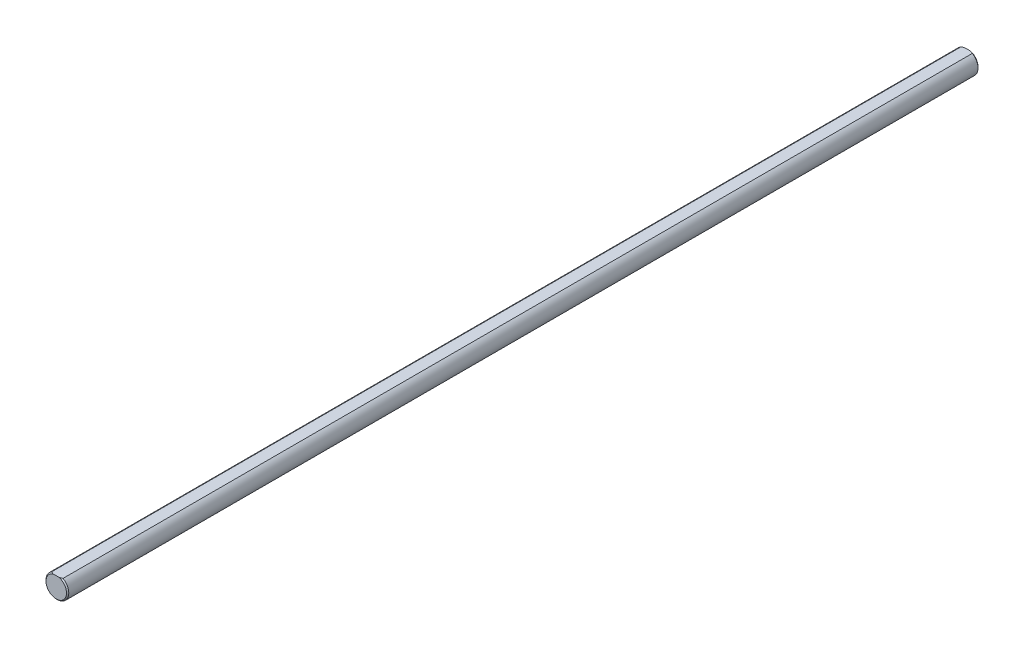
ISO-10303-21;
HEADER;
FILE_DESCRIPTION(('STEP AP214'),'2;1');
FILE_NAME('part.step','',(''),(''),'','','');
FILE_SCHEMA(('AUTOMOTIVE_DESIGN { 1 0 10303 214 1 1 1 1 }'));
ENDSEC;
DATA;
#1=APPLICATION_CONTEXT('core data for automotive mechanical design processes');
#2=APPLICATION_PROTOCOL_DEFINITION('international standard','automotive_design',2000,#1);
#3=PRODUCT_CONTEXT('',#1,'mechanical');
#4=PRODUCT('Part','Part','',(#3));
#5=PRODUCT_RELATED_PRODUCT_CATEGORY('part','',(#4));
#6=PRODUCT_DEFINITION_FORMATION('','',#4);
#7=PRODUCT_DEFINITION_CONTEXT('part definition',#1,'design');
#8=PRODUCT_DEFINITION('design','',#6,#7);
#9=PRODUCT_DEFINITION_SHAPE('','',#8);
#10=(LENGTH_UNIT() NAMED_UNIT(*) SI_UNIT(.MILLI.,.METRE.));
#11=(NAMED_UNIT(*) PLANE_ANGLE_UNIT() SI_UNIT($,.RADIAN.));
#12=(NAMED_UNIT(*) SI_UNIT($,.STERADIAN.) SOLID_ANGLE_UNIT());
#13=UNCERTAINTY_MEASURE_WITH_UNIT(LENGTH_MEASURE(1.E-05),#10,'distance_accuracy_value','');
#14=(GEOMETRIC_REPRESENTATION_CONTEXT(3) GLOBAL_UNCERTAINTY_ASSIGNED_CONTEXT((#13)) GLOBAL_UNIT_ASSIGNED_CONTEXT((#10,
#11,#12)) REPRESENTATION_CONTEXT('',''));
#15=CARTESIAN_POINT('',(0.,0.,0.));
#16=DIRECTION('',(0.,0.,1.));
#17=DIRECTION('',(1.,0.,0.));
#18=AXIS2_PLACEMENT_3D('',#15,#16,#17);
#19=CARTESIAN_POINT('',(0.,0.,200.));
#20=DIRECTION('',(0.,0.,-1.));
#21=DIRECTION('',(-1.,0.,0.));
#22=AXIS2_PLACEMENT_3D('',#19,#20,#21);
#23=CYLINDRICAL_SURFACE('',#22,5.);
#24=DIRECTION('',(0.,0.,1.));
#25=VECTOR('',#24,1.);
#26=CARTESIAN_POINT('',(-2.5,4.33012701892219,-200.));
#27=LINE('',#26,#25);
#28=CARTESIAN_POINT('',(-2.5,4.33012701892219,-199.5));
#29=VERTEX_POINT('',#28);
#30=CARTESIAN_POINT('',(-2.5,4.33012701892219,199.5));
#31=VERTEX_POINT('',#30);
#32=EDGE_CURVE('E88',#29,#31,#27,.T.);
#33=ORIENTED_EDGE('',*,*,#32,.F.);
#34=CARTESIAN_POINT('',(0.,0.,-199.5));
#35=DIRECTION('',(0.,0.,1.));
#36=DIRECTION('',(1.,0.,0.));
#37=AXIS2_PLACEMENT_3D('',#34,#35,#36);
#38=CIRCLE('',#37,5.);
#39=CARTESIAN_POINT('',(2.5,4.33012701892219,-199.5));
#40=VERTEX_POINT('',#39);
#41=EDGE_CURVE('E99',#29,#40,#38,.T.);
#42=ORIENTED_EDGE('',*,*,#41,.T.);
#43=DIRECTION('',(0.,0.,1.));
#44=VECTOR('',#43,1.);
#45=CARTESIAN_POINT('',(2.5,4.33012701892219,-200.));
#46=LINE('',#45,#44);
#47=CARTESIAN_POINT('',(2.5,4.33012701892219,199.5));
#48=VERTEX_POINT('',#47);
#49=EDGE_CURVE('E101',#40,#48,#46,.T.);
#50=ORIENTED_EDGE('',*,*,#49,.T.);
#51=CARTESIAN_POINT('',(0.,0.,199.5));
#52=DIRECTION('',(0.,0.,1.));
#53=DIRECTION('',(1.,0.,0.));
#54=AXIS2_PLACEMENT_3D('',#51,#52,#53);
#55=CIRCLE('',#54,5.);
#56=EDGE_CURVE('E100',#48,#31,#55,.F.);
#57=ORIENTED_EDGE('',*,*,#56,.T.);
#58=EDGE_LOOP('',(#33,#42,#50,#57));
#59=FACE_BOUND('',#58,.T.);
#60=ADVANCED_FACE('F41',(#59),#23,.T.);
#61=CARTESIAN_POINT('',(0.,0.,200.));
#62=DIRECTION('',(0.,0.,1.));
#63=DIRECTION('',(1.,0.,0.));
#64=AXIS2_PLACEMENT_3D('',#61,#62,#63);
#65=PLANE('',#64);
#66=DIRECTION('',(1.,0.,0.));
#67=VECTOR('',#66,1.);
#68=CARTESIAN_POINT('',(-2.5,4.33012701892219,200.));
#69=LINE('',#68,#67);
#70=CARTESIAN_POINT('',(-1.2247448713916,4.33012701892219,200.));
#71=VERTEX_POINT('',#70);
#72=CARTESIAN_POINT('',(1.2247448713916,4.33012701892219,200.));
#73=VERTEX_POINT('',#72);
#74=EDGE_CURVE('E146',#71,#73,#69,.T.);
#75=ORIENTED_EDGE('',*,*,#74,.F.);
#76=CARTESIAN_POINT('',(0.,0.,200.));
#77=DIRECTION('',(0.,0.,1.));
#78=DIRECTION('',(1.,0.,0.));
#79=AXIS2_PLACEMENT_3D('',#76,#77,#78);
#80=CIRCLE('',#79,4.5);
#81=EDGE_CURVE('E11',#71,#73,#80,.T.);
#82=ORIENTED_EDGE('',*,*,#81,.T.);
#83=EDGE_LOOP('',(#75,#82));
#84=FACE_BOUND('',#83,.T.);
#85=ADVANCED_FACE('F139',(#84),#65,.T.);
#86=CARTESIAN_POINT('',(0.,0.,-200.));
#87=DIRECTION('',(0.,0.,1.));
#88=DIRECTION('',(1.,0.,0.));
#89=AXIS2_PLACEMENT_3D('',#86,#87,#88);
#90=PLANE('',#89);
#91=DIRECTION('',(1.,0.,0.));
#92=VECTOR('',#91,1.);
#93=CARTESIAN_POINT('',(-2.5,4.33012701892219,-200.));
#94=LINE('',#93,#92);
#95=CARTESIAN_POINT('',(-1.22474487139201,4.33012701892219,-200.));
#96=VERTEX_POINT('',#95);
#97=CARTESIAN_POINT('',(1.22474487139201,4.33012701892219,-200.));
#98=VERTEX_POINT('',#97);
#99=EDGE_CURVE('E90',#96,#98,#94,.T.);
#100=ORIENTED_EDGE('',*,*,#99,.T.);
#101=CARTESIAN_POINT('',(0.,0.,-200.));
#102=DIRECTION('',(0.,0.,1.));
#103=DIRECTION('',(1.,0.,0.));
#104=AXIS2_PLACEMENT_3D('',#101,#102,#103);
#105=CIRCLE('',#104,4.50000000000012);
#106=EDGE_CURVE('E50',#98,#96,#105,.F.);
#107=ORIENTED_EDGE('',*,*,#106,.T.);
#108=EDGE_LOOP('',(#100,#107));
#109=FACE_BOUND('',#108,.T.);
#110=ADVANCED_FACE('F120',(#109),#90,.F.);
#111=CARTESIAN_POINT('',(-2.5,4.33012701892219,-200.));
#112=DIRECTION('',(0.,-1.,0.));
#113=DIRECTION('',(0.,0.,-1.));
#114=AXIS2_PLACEMENT_3D('',#111,#112,#113);
#115=PLANE('',#114);
#116=ORIENTED_EDGE('',*,*,#49,.F.);
#117=CARTESIAN_POINT('',(2.5,4.33012701892219,-199.5));
#118=CARTESIAN_POINT('',(2.397645932272,4.33012701892219,-199.551162334614));
#119=CARTESIAN_POINT('',(2.29433367303991,4.33012701892219,-199.60047544507));
#120=CARTESIAN_POINT('',(2.08595633192175,4.33012701892219,-199.694528899882));
#121=CARTESIAN_POINT('',(1.98089612421644,4.33012701892219,-199.739280074042));
#122=CARTESIAN_POINT('',(1.76864437799233,4.33012701892219,-199.823609457802));
#123=CARTESIAN_POINT('',(1.66145195332591,4.33012701892219,-199.863185462573));
#124=CARTESIAN_POINT('',(1.44475945950899,4.33012701892219,-199.936349914878));
#125=CARTESIAN_POINT('',(1.33525439885947,4.33012701892219,-199.969923520521));
#126=CARTESIAN_POINT('',(1.224744871392,4.33012701892219,-200.));
#127=B_SPLINE_CURVE_WITH_KNOTS('',3,(#117,#118,#119,#120,#121,#122,#123,#124,#125,#126),
.UNSPECIFIED.,.F.,.F.,(4,2,2,2,4),(0.,0.343311131933385,0.685787291176395,1.02840888681942,
1.37186629240991),.UNSPECIFIED.);
#128=EDGE_CURVE('E94',#40,#98,#127,.T.);
#129=ORIENTED_EDGE('',*,*,#128,.T.);
#130=ORIENTED_EDGE('',*,*,#99,.F.);
#131=CARTESIAN_POINT('',(-1.22474487139201,4.33012701892219,-200.));
#132=CARTESIAN_POINT('',(-1.33525439885948,4.33012701892219,-199.969923520521));
#133=CARTESIAN_POINT('',(-1.444759459509,4.33012701892219,-199.936349914878));
#134=CARTESIAN_POINT('',(-1.66145195332591,4.33012701892219,-199.863185462573));
#135=CARTESIAN_POINT('',(-1.76864437799233,4.33012701892219,-199.823609457802));
#136=CARTESIAN_POINT('',(-1.98089612421644,4.33012701892219,-199.739280074042));
#137=CARTESIAN_POINT('',(-2.08595633192175,4.33012701892219,-199.694528899882));
#138=CARTESIAN_POINT('',(-2.29433367303991,4.33012701892219,-199.60047544507));
#139=CARTESIAN_POINT('',(-2.397645932272,4.33012701892219,-199.551162334614));
#140=CARTESIAN_POINT('',(-2.5,4.33012701892219,-199.5));
#141=B_SPLINE_CURVE_WITH_KNOTS('',3,(#131,#132,#133,#134,#135,#136,#137,#138,#139,#140),
.UNSPECIFIED.,.F.,.F.,(4,2,2,2,4),(0.,0.34345740559048,0.686079001233506,1.02855516047651,
1.3718662924099),.UNSPECIFIED.);
#142=EDGE_CURVE('E84',#96,#29,#141,.T.);
#143=ORIENTED_EDGE('',*,*,#142,.T.);
#144=ORIENTED_EDGE('',*,*,#32,.T.);
#145=CARTESIAN_POINT('',(-2.5,4.33012701892219,199.5));
#146=CARTESIAN_POINT('',(-2.39764593227197,4.33012701892219,199.551162334614));
#147=CARTESIAN_POINT('',(-2.29433367303983,4.33012701892219,199.60047544507));
#148=CARTESIAN_POINT('',(-2.08595633192161,4.33012701892219,199.694528899882));
#149=CARTESIAN_POINT('',(-1.98089612421628,4.33012701892219,199.739280074042));
#150=CARTESIAN_POINT('',(-1.76864437799211,4.33012701892219,199.823609457802));
#151=CARTESIAN_POINT('',(-1.66145195332565,4.33012701892219,199.863185462573));
#152=CARTESIAN_POINT('',(-1.44475945950867,4.33012701892219,199.936349914878));
#153=CARTESIAN_POINT('',(-1.33525439885912,4.33012701892219,199.969923520521));
#154=CARTESIAN_POINT('',(-1.22474487139161,4.33012701892219,200.));
#155=B_SPLINE_CURVE_WITH_KNOTS('',3,(#145,#146,#147,#148,#149,#150,#151,#152,#153,#154),
.UNSPECIFIED.,.F.,.F.,(4,2,2,2,4),(0.,0.34331113193351,0.685787291176604,1.02840888681972,
1.37186629241031),.UNSPECIFIED.);
#156=EDGE_CURVE('E64',#31,#71,#155,.T.);
#157=ORIENTED_EDGE('',*,*,#156,.T.);
#158=ORIENTED_EDGE('',*,*,#74,.T.);
#159=CARTESIAN_POINT('',(1.2247448713916,4.33012701892219,200.));
#160=CARTESIAN_POINT('',(1.3352543988591,4.33012701892219,199.969923520521));
#161=CARTESIAN_POINT('',(1.44475945950865,4.33012701892219,199.936349914878));
#162=CARTESIAN_POINT('',(1.66145195332564,4.33012701892219,199.863185462573));
#163=CARTESIAN_POINT('',(1.7686443779921,4.33012701892219,199.823609457802));
#164=CARTESIAN_POINT('',(1.98089612421627,4.33012701892219,199.739280074042));
#165=CARTESIAN_POINT('',(2.08595633192161,4.33012701892219,199.694528899882));
#166=CARTESIAN_POINT('',(2.29433367303983,4.33012701892219,199.60047544507));
#167=CARTESIAN_POINT('',(2.39764593227196,4.33012701892219,199.551162334614));
#168=CARTESIAN_POINT('',(2.5,4.33012701892219,199.5));
#169=B_SPLINE_CURVE_WITH_KNOTS('',3,(#159,#160,#161,#162,#163,#164,#165,#166,#167,#168),
.UNSPECIFIED.,.F.,.F.,(4,2,2,2,4),(0.,0.343457405590578,0.686079001233712,1.02855516047681,
1.37186629241032),.UNSPECIFIED.);
#170=EDGE_CURVE('E57',#73,#48,#169,.T.);
#171=ORIENTED_EDGE('',*,*,#170,.T.);
#172=EDGE_LOOP('',(#116,#129,#130,#143,#144,#157,#158,#171));
#173=FACE_BOUND('',#172,.T.);
#174=ADVANCED_FACE('F87',(#173),#115,.F.);
#175=CARTESIAN_POINT('',(0.,0.,-199.5));
#176=DIRECTION('',(0.,0.,1.));
#177=DIRECTION('',(1.,0.,0.));
#178=AXIS2_PLACEMENT_3D('',#175,#176,#177);
#179=CONICAL_SURFACE('',#178,5.,0.785398163397444);
#180=ORIENTED_EDGE('',*,*,#142,.F.);
#181=ORIENTED_EDGE('',*,*,#106,.F.);
#182=ORIENTED_EDGE('',*,*,#128,.F.);
#183=ORIENTED_EDGE('',*,*,#41,.F.);
#184=EDGE_LOOP('',(#180,#181,#182,#183));
#185=FACE_BOUND('',#184,.T.);
#186=ADVANCED_FACE('F103',(#185),#179,.T.);
#187=CARTESIAN_POINT('',(0.,0.,200.));
#188=DIRECTION('',(0.,0.,-1.));
#189=DIRECTION('',(-1.,0.,0.));
#190=AXIS2_PLACEMENT_3D('',#187,#188,#189);
#191=CONICAL_SURFACE('',#190,4.5,0.785398163397444);
#192=ORIENTED_EDGE('',*,*,#156,.F.);
#193=ORIENTED_EDGE('',*,*,#56,.F.);
#194=ORIENTED_EDGE('',*,*,#170,.F.);
#195=ORIENTED_EDGE('',*,*,#81,.F.);
#196=EDGE_LOOP('',(#192,#193,#194,#195));
#197=FACE_BOUND('',#196,.T.);
#198=ADVANCED_FACE('F43',(#197),#191,.T.);
#199=CLOSED_SHELL('',(#60,#85,#110,#174,#186,#198));
#200=MANIFOLD_SOLID_BREP('B2',#199);
#201=ADVANCED_BREP_SHAPE_REPRESENTATION('',(#18,#200),#14);
#202=SHAPE_DEFINITION_REPRESENTATION(#9,#201);
ENDSEC;
END-ISO-10303-21;
